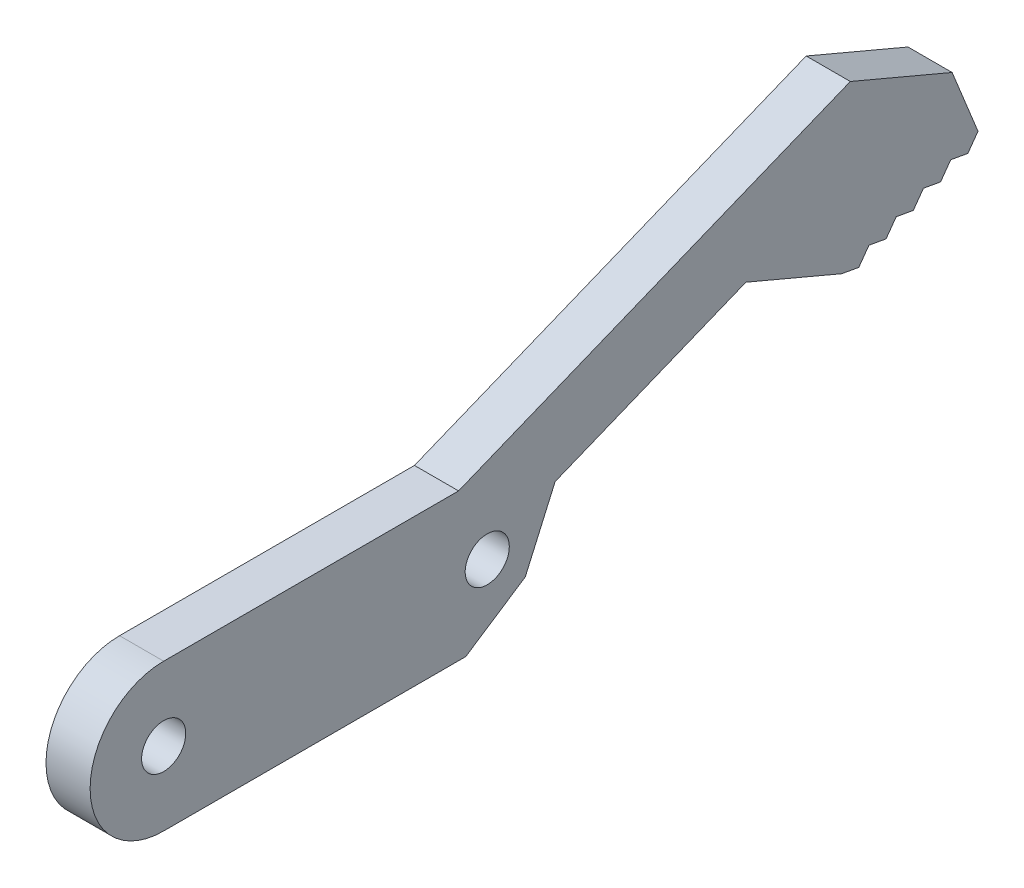
ISO-10303-21;
HEADER;
FILE_DESCRIPTION(('STEP AP214'),'2;1');
FILE_NAME('part.step','',(''),(''),'','','');
FILE_SCHEMA(('AUTOMOTIVE_DESIGN { 1 0 10303 214 1 1 1 1 }'));
ENDSEC;
DATA;
#1=APPLICATION_CONTEXT('core data for automotive mechanical design processes');
#2=APPLICATION_PROTOCOL_DEFINITION('international standard','automotive_design',2000,#1);
#3=PRODUCT_CONTEXT('',#1,'mechanical');
#4=PRODUCT('Part','Part','',(#3));
#5=PRODUCT_RELATED_PRODUCT_CATEGORY('part','',(#4));
#6=PRODUCT_DEFINITION_FORMATION('','',#4);
#7=PRODUCT_DEFINITION_CONTEXT('part definition',#1,'design');
#8=PRODUCT_DEFINITION('design','',#6,#7);
#9=PRODUCT_DEFINITION_SHAPE('','',#8);
#10=(LENGTH_UNIT() NAMED_UNIT(*) SI_UNIT(.MILLI.,.METRE.));
#11=(NAMED_UNIT(*) PLANE_ANGLE_UNIT() SI_UNIT($,.RADIAN.));
#12=(NAMED_UNIT(*) SI_UNIT($,.STERADIAN.) SOLID_ANGLE_UNIT());
#13=UNCERTAINTY_MEASURE_WITH_UNIT(LENGTH_MEASURE(1.E-05),#10,'distance_accuracy_value','');
#14=(GEOMETRIC_REPRESENTATION_CONTEXT(3) GLOBAL_UNCERTAINTY_ASSIGNED_CONTEXT((#13)) GLOBAL_UNIT_ASSIGNED_CONTEXT((#10,
#11,#12)) REPRESENTATION_CONTEXT('',''));
#15=CARTESIAN_POINT('',(0.,0.,0.));
#16=DIRECTION('',(0.,0.,1.));
#17=DIRECTION('',(1.,0.,0.));
#18=AXIS2_PLACEMENT_3D('',#15,#16,#17);
#19=CARTESIAN_POINT('',(3.,5.,-42.2186144567226));
#20=DIRECTION('',(1.,0.,0.));
#21=DIRECTION('',(0.,0.,-1.));
#22=AXIS2_PLACEMENT_3D('',#19,#20,#21);
#23=PLANE('',#22);
#24=CARTESIAN_POINT('',(3.,5.,-5.));
#25=DIRECTION('',(1.,0.,0.));
#26=DIRECTION('',(0.,0.,-1.));
#27=AXIS2_PLACEMENT_3D('',#24,#25,#26);
#28=CIRCLE('',#27,1.5);
#29=CARTESIAN_POINT('',(3.,5.,-6.5));
#30=VERTEX_POINT('',#29);
#31=EDGE_CURVE('E152',#30,#30,#28,.T.);
#32=ORIENTED_EDGE('',*,*,#31,.F.);
#33=EDGE_LOOP('',(#32));
#34=FACE_BOUND('',#33,.T.);
#35=CARTESIAN_POINT('',(3.,5.,-27.));
#36=DIRECTION('',(1.,0.,0.));
#37=DIRECTION('',(0.,0.,-1.));
#38=AXIS2_PLACEMENT_3D('',#35,#36,#37);
#39=CIRCLE('',#38,1.5);
#40=CARTESIAN_POINT('',(3.,5.,-28.5));
#41=VERTEX_POINT('',#40);
#42=EDGE_CURVE('E123',#41,#41,#39,.T.);
#43=ORIENTED_EDGE('',*,*,#42,.F.);
#44=EDGE_LOOP('',(#43));
#45=FACE_BOUND('',#44,.T.);
#46=DIRECTION('',(0.,-0.17631045866029,-0.984334608843455));
#47=VECTOR('',#46,1.);
#48=CARTESIAN_POINT('',(3.,22.5251811729284,-4.03462906650347));
#49=LINE('',#48,#47);
#50=CARTESIAN_POINT('',(3.,12.7674293983212,-58.5117874224691));
#51=VERTEX_POINT('',#50);
#52=CARTESIAN_POINT('',(3.,12.5590471430907,-59.6751776560989));
#53=VERTEX_POINT('',#52);
#54=EDGE_CURVE('E327',#51,#53,#49,.T.);
#55=ORIENTED_EDGE('',*,*,#54,.T.);
#56=DIRECTION('',(0.,0.811746559900308,-0.58400986506224));
#57=VECTOR('',#56,1.);
#58=CARTESIAN_POINT('',(3.,-24.0066089622226,-33.3680703114137));
#59=LINE('',#58,#57);
#60=CARTESIAN_POINT('',(3.,13.5184546570459,-60.365421976732));
#61=VERTEX_POINT('',#60);
#62=EDGE_CURVE('E342',#53,#61,#59,.T.);
#63=ORIENTED_EDGE('',*,*,#62,.T.);
#64=DIRECTION('',(0.,0.926817277131444,0.37551262936239));
#65=VECTOR('',#64,1.);
#66=CARTESIAN_POINT('',(3.,22.9153076592473,-56.5581591368443));
#67=LINE('',#66,#65);
#68=CARTESIAN_POINT('',(3.,17.8605936004067,-58.6061453081692));
#69=VERTEX_POINT('',#68);
#70=EDGE_CURVE('E86',#61,#69,#67,.T.);
#71=ORIENTED_EDGE('',*,*,#70,.T.);
#72=DIRECTION('',(0.,-0.389831254937164,-0.920886308223831));
#73=VECTOR('',#72,1.);
#74=CARTESIAN_POINT('',(3.,36.1853832829632,-15.318061795041));
#75=LINE('',#74,#73);
#76=CARTESIAN_POINT('',(3.,20.7907778032993,-51.6842618551546));
#77=VERTEX_POINT('',#76);
#78=EDGE_CURVE('E240',#77,#69,#75,.T.);
#79=ORIENTED_EDGE('',*,*,#78,.F.);
#80=DIRECTION('',(0.,-0.375512629362391,0.926817277131444));
#81=VECTOR('',#80,1.);
#82=CARTESIAN_POINT('',(3.,-0.128680230886938,-0.0521365462638659));
#83=LINE('',#82,#81);
#84=CARTESIAN_POINT('',(3.,10.,-25.0511248584953));
#85=VERTEX_POINT('',#84);
#86=EDGE_CURVE('E208',#77,#85,#83,.T.);
#87=ORIENTED_EDGE('',*,*,#86,.T.);
#88=DIRECTION('',(0.,0.,-1.));
#89=VECTOR('',#88,1.);
#90=CARTESIAN_POINT('',(3.,10.,-42.2186144567226));
#91=LINE('',#90,#89);
#92=CARTESIAN_POINT('',(3.,10.,-5.));
#93=VERTEX_POINT('',#92);
#94=EDGE_CURVE('E138',#93,#85,#91,.T.);
#95=ORIENTED_EDGE('',*,*,#94,.F.);
#96=CARTESIAN_POINT('',(3.,5.,-5.));
#97=DIRECTION('',(1.,0.,0.));
#98=DIRECTION('',(0.,0.,-1.));
#99=AXIS2_PLACEMENT_3D('',#96,#97,#98);
#100=CIRCLE('',#99,5.);
#101=CARTESIAN_POINT('',(3.,0.,-5.));
#102=VERTEX_POINT('',#101);
#103=EDGE_CURVE('E94',#93,#102,#100,.T.);
#104=ORIENTED_EDGE('',*,*,#103,.T.);
#105=DIRECTION('',(0.,0.,-1.));
#106=VECTOR('',#105,1.);
#107=CARTESIAN_POINT('',(3.,0.,-42.2186144567226));
#108=LINE('',#107,#106);
#109=CARTESIAN_POINT('',(3.,0.,-25.5395379901429));
#110=VERTEX_POINT('',#109);
#111=EDGE_CURVE('E122',#102,#110,#108,.T.);
#112=ORIENTED_EDGE('',*,*,#111,.T.);
#113=DIRECTION('',(0.,-0.55021058417257,0.835025935563968));
#114=VECTOR('',#113,1.);
#115=CARTESIAN_POINT('',(3.,-11.7338880875041,-7.73162741930979));
#116=LINE('',#115,#114);
#117=CARTESIAN_POINT('',(3.,2.66487171427478,-29.5838749410881));
#118=VERTEX_POINT('',#117);
#119=EDGE_CURVE('E249',#118,#110,#116,.T.);
#120=ORIENTED_EDGE('',*,*,#119,.F.);
#121=DIRECTION('',(0.,-0.914855352080967,0.403781729117119));
#122=VECTOR('',#121,1.);
#123=CARTESIAN_POINT('',(3.,-10.4938590570204,-23.7761206860199));
#124=LINE('',#123,#122);
#125=CARTESIAN_POINT('',(3.,7.0958518163384,-31.5395379901429));
#126=VERTEX_POINT('',#125);
#127=EDGE_CURVE('E253',#126,#118,#124,.T.);
#128=ORIENTED_EDGE('',*,*,#127,.F.);
#129=DIRECTION('',(0.,-0.920886308223829,0.389831254937168));
#130=VECTOR('',#129,1.);
#131=CARTESIAN_POINT('',(3.,-10.2440418078816,-24.1991829086949));
#132=LINE('',#131,#130);
#133=CARTESIAN_POINT('',(3.,7.26267479119386,-31.6101577931083));
#134=VERTEX_POINT('',#133);
#135=EDGE_CURVE('E172',#134,#126,#132,.T.);
#136=ORIENTED_EDGE('',*,*,#135,.F.);
#137=DIRECTION('',(0.,0.375512629362391,-0.926817277131444));
#138=VECTOR('',#137,1.);
#139=CARTESIAN_POINT('',(3.,-4.76276661654416,-1.92969969307582));
#140=LINE('',#139,#138);
#141=CARTESIAN_POINT('',(3.,12.5198516022673,-44.5855996729485));
#142=VERTEX_POINT('',#141);
#143=EDGE_CURVE('E202',#134,#142,#140,.T.);
#144=ORIENTED_EDGE('',*,*,#143,.T.);
#145=DIRECTION('',(0.,-0.389831254937164,-0.920886308223831));
#146=VECTOR('',#145,1.);
#147=CARTESIAN_POINT('',(3.,26.6230259445322,-11.2701074187967));
#148=LINE('',#147,#146);
#149=CARTESIAN_POINT('',(3.,9.76332836342207,-51.0972492054176));
#150=VERTEX_POINT('',#149);
#151=EDGE_CURVE('E205',#142,#150,#148,.T.);
#152=ORIENTED_EDGE('',*,*,#151,.T.);
#153=DIRECTION('',(0.,-0.176310458660284,-0.984334608843456));
#154=VECTOR('',#153,1.);
#155=CARTESIAN_POINT('',(3.,18.3276818691169,-3.28278815708864));
#156=LINE('',#155,#154);
#157=CARTESIAN_POINT('',(3.,9.55494610819164,-52.2606394390473));
#158=VERTEX_POINT('',#157);
#159=EDGE_CURVE('E262',#150,#158,#156,.T.);
#160=ORIENTED_EDGE('',*,*,#159,.T.);
#161=DIRECTION('',(0.,0.811746559900305,-0.584009865062245));
#162=VECTOR('',#161,1.);
#163=CARTESIAN_POINT('',(3.,-21.5162149640903,-29.9065384406036));
#164=LINE('',#163,#162);
#165=CARTESIAN_POINT('',(3.,10.5143536221468,-52.9508837596805));
#166=VERTEX_POINT('',#165);
#167=EDGE_CURVE('E273',#158,#166,#164,.T.);
#168=ORIENTED_EDGE('',*,*,#167,.T.);
#169=DIRECTION('',(0.,-0.176310458660287,-0.984334608843456));
#170=VECTOR('',#169,1.);
#171=CARTESIAN_POINT('',(3.,19.3770566950698,-3.47074838444237));
#172=LINE('',#171,#170);
#173=CARTESIAN_POINT('',(3.,10.3059713669164,-54.1142739933102));
#174=VERTEX_POINT('',#173);
#175=EDGE_CURVE('E280',#166,#174,#172,.T.);
#176=ORIENTED_EDGE('',*,*,#175,.T.);
#177=DIRECTION('',(0.,0.811746559900305,-0.584009865062244));
#178=VECTOR('',#177,1.);
#179=CARTESIAN_POINT('',(3.,-22.1388134636234,-30.7719214083061));
#180=LINE('',#179,#178);
#181=CARTESIAN_POINT('',(3.,11.2653788808716,-54.8045183139433));
#182=VERTEX_POINT('',#181);
#183=EDGE_CURVE('E277',#174,#182,#180,.T.);
#184=ORIENTED_EDGE('',*,*,#183,.T.);
#185=DIRECTION('',(0.,-0.176310458660285,-0.984334608843456));
#186=VECTOR('',#185,1.);
#187=CARTESIAN_POINT('',(3.,20.4264315210225,-3.65870861179599));
#188=LINE('',#187,#186);
#189=CARTESIAN_POINT('',(3.,11.0569966256412,-55.9679085475731));
#190=VERTEX_POINT('',#189);
#191=EDGE_CURVE('E292',#182,#190,#188,.T.);
#192=ORIENTED_EDGE('',*,*,#191,.T.);
#193=DIRECTION('',(0.,0.811746559900305,-0.584009865062245));
#194=VECTOR('',#193,1.);
#195=CARTESIAN_POINT('',(3.,-22.7614119631564,-31.6373043760085));
#196=LINE('',#195,#194);
#197=CARTESIAN_POINT('',(3.,12.0164041395964,-56.6581528682062));
#198=VERTEX_POINT('',#197);
#199=EDGE_CURVE('E291',#190,#198,#196,.T.);
#200=ORIENTED_EDGE('',*,*,#199,.T.);
#201=DIRECTION('',(0.,-0.176310458660293,-0.984334608843455));
#202=VECTOR('',#201,1.);
#203=CARTESIAN_POINT('',(3.,21.4758063469757,-3.8466688391499));
#204=LINE('',#203,#202);
#205=CARTESIAN_POINT('',(3.,11.808021884366,-57.821543101836));
#206=VERTEX_POINT('',#205);
#207=EDGE_CURVE('E310',#198,#206,#204,.T.);
#208=ORIENTED_EDGE('',*,*,#207,.T.);
#209=DIRECTION('',(0.,0.811746559900307,-0.584009865062241));
#210=VECTOR('',#209,1.);
#211=CARTESIAN_POINT('',(3.,-23.3840104626895,-32.5026873437112));
#212=LINE('',#211,#210);
#213=EDGE_CURVE('E309',#206,#51,#212,.T.);
#214=ORIENTED_EDGE('',*,*,#213,.T.);
#215=EDGE_LOOP('',(#55,#63,#71,#79,#87,#95,#104,#112,#120,#128,#136,#144,#152,#160,#168,#176,
#184,#192,#200,#208,#214));
#216=FACE_BOUND('',#215,.T.);
#217=ADVANCED_FACE('F71',(#34,#45,#216),#23,.T.);
#218=CARTESIAN_POINT('',(0.,5.,-42.2186144567226));
#219=DIRECTION('',(1.,0.,0.));
#220=DIRECTION('',(0.,0.,-1.));
#221=AXIS2_PLACEMENT_3D('',#218,#219,#220);
#222=PLANE('',#221);
#223=CARTESIAN_POINT('',(0.,5.,-5.));
#224=DIRECTION('',(1.,0.,0.));
#225=DIRECTION('',(0.,0.,-1.));
#226=AXIS2_PLACEMENT_3D('',#223,#224,#225);
#227=CIRCLE('',#226,1.5);
#228=CARTESIAN_POINT('',(0.,5.,-6.5));
#229=VERTEX_POINT('',#228);
#230=EDGE_CURVE('E130',#229,#229,#227,.T.);
#231=ORIENTED_EDGE('',*,*,#230,.T.);
#232=EDGE_LOOP('',(#231));
#233=FACE_BOUND('',#232,.T.);
#234=CARTESIAN_POINT('',(0.,5.,-27.));
#235=DIRECTION('',(1.,0.,0.));
#236=DIRECTION('',(0.,0.,-1.));
#237=AXIS2_PLACEMENT_3D('',#234,#235,#236);
#238=CIRCLE('',#237,1.5);
#239=CARTESIAN_POINT('',(0.,5.,-28.5));
#240=VERTEX_POINT('',#239);
#241=EDGE_CURVE('E133',#240,#240,#238,.T.);
#242=ORIENTED_EDGE('',*,*,#241,.T.);
#243=EDGE_LOOP('',(#242));
#244=FACE_BOUND('',#243,.T.);
#245=DIRECTION('',(0.,-0.811746559900308,0.58400986506224));
#246=VECTOR('',#245,1.);
#247=CARTESIAN_POINT('',(0.,-24.0066089622226,-33.3680703114137));
#248=LINE('',#247,#246);
#249=CARTESIAN_POINT('',(0.,13.5184546570459,-60.365421976732));
#250=VERTEX_POINT('',#249);
#251=CARTESIAN_POINT('',(0.,12.5590471430907,-59.6751776560989));
#252=VERTEX_POINT('',#251);
#253=EDGE_CURVE('E340',#250,#252,#248,.T.);
#254=ORIENTED_EDGE('',*,*,#253,.T.);
#255=DIRECTION('',(0.,0.17631045866029,0.984334608843455));
#256=VECTOR('',#255,1.);
#257=CARTESIAN_POINT('',(0.,22.5251811729284,-4.03462906650347));
#258=LINE('',#257,#256);
#259=CARTESIAN_POINT('',(0.,12.7674293983212,-58.5117874224691));
#260=VERTEX_POINT('',#259);
#261=EDGE_CURVE('E323',#252,#260,#258,.T.);
#262=ORIENTED_EDGE('',*,*,#261,.T.);
#263=DIRECTION('',(0.,-0.811746559900307,0.584009865062241));
#264=VECTOR('',#263,1.);
#265=CARTESIAN_POINT('',(0.,-23.3840104626895,-32.5026873437112));
#266=LINE('',#265,#264);
#267=CARTESIAN_POINT('',(0.,11.808021884366,-57.821543101836));
#268=VERTEX_POINT('',#267);
#269=EDGE_CURVE('E333',#260,#268,#266,.T.);
#270=ORIENTED_EDGE('',*,*,#269,.T.);
#271=DIRECTION('',(0.,0.176310458660293,0.984334608843455));
#272=VECTOR('',#271,1.);
#273=CARTESIAN_POINT('',(0.,21.4758063469757,-3.8466688391499));
#274=LINE('',#273,#272);
#275=CARTESIAN_POINT('',(0.,12.0164041395964,-56.6581528682062));
#276=VERTEX_POINT('',#275);
#277=EDGE_CURVE('E305',#268,#276,#274,.T.);
#278=ORIENTED_EDGE('',*,*,#277,.T.);
#279=DIRECTION('',(0.,-0.811746559900304,0.584009865062245));
#280=VECTOR('',#279,1.);
#281=CARTESIAN_POINT('',(0.,-22.7614119631564,-31.6373043760085));
#282=LINE('',#281,#280);
#283=CARTESIAN_POINT('',(0.,11.0569966256412,-55.9679085475731));
#284=VERTEX_POINT('',#283);
#285=EDGE_CURVE('E316',#276,#284,#282,.T.);
#286=ORIENTED_EDGE('',*,*,#285,.T.);
#287=DIRECTION('',(0.,0.176310458660285,0.984334608843456));
#288=VECTOR('',#287,1.);
#289=CARTESIAN_POINT('',(0.,20.4264315210225,-3.65870861179599));
#290=LINE('',#289,#288);
#291=CARTESIAN_POINT('',(0.,11.2653788808716,-54.8045183139433));
#292=VERTEX_POINT('',#291);
#293=EDGE_CURVE('E287',#284,#292,#290,.T.);
#294=ORIENTED_EDGE('',*,*,#293,.T.);
#295=DIRECTION('',(0.,-0.811746559900305,0.584009865062244));
#296=VECTOR('',#295,1.);
#297=CARTESIAN_POINT('',(0.,-22.1388134636234,-30.7719214083061));
#298=LINE('',#297,#296);
#299=CARTESIAN_POINT('',(0.,10.3059713669164,-54.1142739933102));
#300=VERTEX_POINT('',#299);
#301=EDGE_CURVE('E298',#292,#300,#298,.T.);
#302=ORIENTED_EDGE('',*,*,#301,.T.);
#303=DIRECTION('',(0.,0.176310458660287,0.984334608843456));
#304=VECTOR('',#303,1.);
#305=CARTESIAN_POINT('',(0.,19.3770566950698,-3.47074838444237));
#306=LINE('',#305,#304);
#307=CARTESIAN_POINT('',(0.,10.5143536221468,-52.9508837596805));
#308=VERTEX_POINT('',#307);
#309=EDGE_CURVE('E269',#300,#308,#306,.T.);
#310=ORIENTED_EDGE('',*,*,#309,.T.);
#311=DIRECTION('',(0.,-0.811746559900305,0.584009865062245));
#312=VECTOR('',#311,1.);
#313=CARTESIAN_POINT('',(0.,-21.5162149640903,-29.9065384406036));
#314=LINE('',#313,#312);
#315=CARTESIAN_POINT('',(0.,9.55494610819165,-52.2606394390473));
#316=VERTEX_POINT('',#315);
#317=EDGE_CURVE('E274',#308,#316,#314,.T.);
#318=ORIENTED_EDGE('',*,*,#317,.T.);
#319=DIRECTION('',(0.,0.176310458660284,0.984334608843456));
#320=VECTOR('',#319,1.);
#321=CARTESIAN_POINT('',(0.,18.3276818691169,-3.28278815708864));
#322=LINE('',#321,#320);
#323=CARTESIAN_POINT('',(0.,9.76332836342207,-51.0972492054176));
#324=VERTEX_POINT('',#323);
#325=EDGE_CURVE('E265',#316,#324,#322,.T.);
#326=ORIENTED_EDGE('',*,*,#325,.T.);
#327=DIRECTION('',(0.,-0.389831254937164,-0.920886308223831));
#328=VECTOR('',#327,1.);
#329=CARTESIAN_POINT('',(0.,26.6230259445322,-11.2701074187967));
#330=LINE('',#329,#328);
#331=CARTESIAN_POINT('',(0.,12.5198516022673,-44.5855996729485));
#332=VERTEX_POINT('',#331);
#333=EDGE_CURVE('E213',#332,#324,#330,.T.);
#334=ORIENTED_EDGE('',*,*,#333,.F.);
#335=DIRECTION('',(0.,0.375512629362391,-0.926817277131444));
#336=VECTOR('',#335,1.);
#337=CARTESIAN_POINT('',(0.,-4.76276661654416,-1.92969969307582));
#338=LINE('',#337,#336);
#339=CARTESIAN_POINT('',(0.,7.26267479119386,-31.6101577931083));
#340=VERTEX_POINT('',#339);
#341=EDGE_CURVE('E211',#340,#332,#338,.T.);
#342=ORIENTED_EDGE('',*,*,#341,.F.);
#343=DIRECTION('',(0.,-0.920886308223829,0.389831254937168));
#344=VECTOR('',#343,1.);
#345=CARTESIAN_POINT('',(0.,-10.2440418078816,-24.1991829086949));
#346=LINE('',#345,#344);
#347=CARTESIAN_POINT('',(0.,7.0958518163384,-31.5395379901429));
#348=VERTEX_POINT('',#347);
#349=EDGE_CURVE('E185',#340,#348,#346,.T.);
#350=ORIENTED_EDGE('',*,*,#349,.T.);
#351=DIRECTION('',(0.,0.914855352080967,-0.40378172911712));
#352=VECTOR('',#351,1.);
#353=CARTESIAN_POINT('',(0.,-10.4938590570204,-23.7761206860199));
#354=LINE('',#353,#352);
#355=CARTESIAN_POINT('',(0.,2.66487171427478,-29.5838749410881));
#356=VERTEX_POINT('',#355);
#357=EDGE_CURVE('E256',#356,#348,#354,.T.);
#358=ORIENTED_EDGE('',*,*,#357,.F.);
#359=DIRECTION('',(0.,0.55021058417257,-0.835025935563968));
#360=VECTOR('',#359,1.);
#361=CARTESIAN_POINT('',(0.,-11.7338880875041,-7.73162741930979));
#362=LINE('',#361,#360);
#363=CARTESIAN_POINT('',(0.,0.,-25.5395379901429));
#364=VERTEX_POINT('',#363);
#365=EDGE_CURVE('E129',#364,#356,#362,.T.);
#366=ORIENTED_EDGE('',*,*,#365,.F.);
#367=DIRECTION('',(0.,0.,-1.));
#368=VECTOR('',#367,1.);
#369=CARTESIAN_POINT('',(0.,0.,-42.2186144567226));
#370=LINE('',#369,#368);
#371=CARTESIAN_POINT('',(0.,0.,-5.));
#372=VERTEX_POINT('',#371);
#373=EDGE_CURVE('E114',#372,#364,#370,.T.);
#374=ORIENTED_EDGE('',*,*,#373,.F.);
#375=CARTESIAN_POINT('',(0.,5.,-5.));
#376=DIRECTION('',(1.,0.,0.));
#377=DIRECTION('',(0.,0.,-1.));
#378=AXIS2_PLACEMENT_3D('',#375,#376,#377);
#379=CIRCLE('',#378,5.);
#380=CARTESIAN_POINT('',(0.,10.,-5.));
#381=VERTEX_POINT('',#380);
#382=EDGE_CURVE('E106',#381,#372,#379,.T.);
#383=ORIENTED_EDGE('',*,*,#382,.F.);
#384=DIRECTION('',(0.,0.,-1.));
#385=VECTOR('',#384,1.);
#386=CARTESIAN_POINT('',(0.,10.,-42.2186144567226));
#387=LINE('',#386,#385);
#388=CARTESIAN_POINT('',(0.,10.,-25.0511248584953));
#389=VERTEX_POINT('',#388);
#390=EDGE_CURVE('E115',#381,#389,#387,.T.);
#391=ORIENTED_EDGE('',*,*,#390,.T.);
#392=DIRECTION('',(0.,-0.375512629362391,0.926817277131444));
#393=VECTOR('',#392,1.);
#394=CARTESIAN_POINT('',(0.,-0.128680230886938,-0.0521365462638659));
#395=LINE('',#394,#393);
#396=CARTESIAN_POINT('',(0.,20.7907778032993,-51.6842618551546));
#397=VERTEX_POINT('',#396);
#398=EDGE_CURVE('E192',#397,#389,#395,.T.);
#399=ORIENTED_EDGE('',*,*,#398,.F.);
#400=DIRECTION('',(0.,-0.389831254937164,-0.920886308223831));
#401=VECTOR('',#400,1.);
#402=CARTESIAN_POINT('',(0.,36.1853832829632,-15.318061795041));
#403=LINE('',#402,#401);
#404=CARTESIAN_POINT('',(0.,17.8605936004068,-58.6061453081692));
#405=VERTEX_POINT('',#404);
#406=EDGE_CURVE('E238',#397,#405,#403,.T.);
#407=ORIENTED_EDGE('',*,*,#406,.T.);
#408=DIRECTION('',(0.,0.926817277131444,0.37551262936239));
#409=VECTOR('',#408,1.);
#410=CARTESIAN_POINT('',(0.,22.9153076592473,-56.5581591368443));
#411=LINE('',#410,#409);
#412=EDGE_CURVE('E198',#250,#405,#411,.T.);
#413=ORIENTED_EDGE('',*,*,#412,.F.);
#414=EDGE_LOOP('',(#254,#262,#270,#278,#286,#294,#302,#310,#318,#326,#334,#342,#350,#358,#366,
#374,#383,#391,#399,#407,#413));
#415=FACE_BOUND('',#414,.T.);
#416=ADVANCED_FACE('F126',(#233,#244,#415),#222,.F.);
#417=CARTESIAN_POINT('',(0.,22.9153076592473,-56.5581591368443));
#418=DIRECTION('',(0.,0.37551262936239,-0.926817277131444));
#419=DIRECTION('',(0.,0.926817277131444,0.37551262936239));
#420=AXIS2_PLACEMENT_3D('',#417,#418,#419);
#421=PLANE('',#420);
#422=ORIENTED_EDGE('',*,*,#70,.F.);
#423=DIRECTION('',(1.,0.,0.));
#424=VECTOR('',#423,1.);
#425=CARTESIAN_POINT('',(-0.00100000000000013,13.5184546570459,-60.365421976732));
#426=LINE('',#425,#424);
#427=EDGE_CURVE('E230',#250,#61,#426,.T.);
#428=ORIENTED_EDGE('',*,*,#427,.F.);
#429=ORIENTED_EDGE('',*,*,#412,.T.);
#430=DIRECTION('',(1.,0.,0.));
#431=VECTOR('',#430,1.);
#432=CARTESIAN_POINT('',(0.,17.8605936004068,-58.6061453081692));
#433=LINE('',#432,#431);
#434=EDGE_CURVE('E206',#405,#69,#433,.T.);
#435=ORIENTED_EDGE('',*,*,#434,.T.);
#436=EDGE_LOOP('',(#422,#428,#429,#435));
#437=FACE_BOUND('',#436,.T.);
#438=ADVANCED_FACE('F227',(#437),#421,.T.);
#439=CARTESIAN_POINT('',(3.,10.,-42.2186144567226));
#440=DIRECTION('',(0.,1.,0.));
#441=DIRECTION('',(0.,0.,1.));
#442=AXIS2_PLACEMENT_3D('',#439,#440,#441);
#443=PLANE('',#442);
#444=DIRECTION('',(1.,0.,0.));
#445=VECTOR('',#444,1.);
#446=CARTESIAN_POINT('',(0.,10.,-25.0511248584953));
#447=LINE('',#446,#445);
#448=EDGE_CURVE('E169',#389,#85,#447,.T.);
#449=ORIENTED_EDGE('',*,*,#448,.F.);
#450=ORIENTED_EDGE('',*,*,#390,.F.);
#451=DIRECTION('',(-1.,0.,0.));
#452=VECTOR('',#451,1.);
#453=CARTESIAN_POINT('',(3.,10.,-5.));
#454=LINE('',#453,#452);
#455=EDGE_CURVE('E12',#93,#381,#454,.T.);
#456=ORIENTED_EDGE('',*,*,#455,.F.);
#457=ORIENTED_EDGE('',*,*,#94,.T.);
#458=EDGE_LOOP('',(#449,#450,#456,#457));
#459=FACE_BOUND('',#458,.T.);
#460=ADVANCED_FACE('F73',(#459),#443,.T.);
#461=CARTESIAN_POINT('',(3.,5.,-5.));
#462=DIRECTION('',(-1.,0.,0.));
#463=DIRECTION('',(0.,0.,1.));
#464=AXIS2_PLACEMENT_3D('',#461,#462,#463);
#465=CYLINDRICAL_SURFACE('',#464,5.);
#466=ORIENTED_EDGE('',*,*,#382,.T.);
#467=DIRECTION('',(-1.,0.,0.));
#468=VECTOR('',#467,1.);
#469=CARTESIAN_POINT('',(3.,0.,-5.));
#470=LINE('',#469,#468);
#471=EDGE_CURVE('E79',#102,#372,#470,.T.);
#472=ORIENTED_EDGE('',*,*,#471,.F.);
#473=ORIENTED_EDGE('',*,*,#103,.F.);
#474=ORIENTED_EDGE('',*,*,#455,.T.);
#475=EDGE_LOOP('',(#466,#472,#473,#474));
#476=FACE_BOUND('',#475,.T.);
#477=ADVANCED_FACE('F108',(#476),#465,.T.);
#478=CARTESIAN_POINT('',(3.,0.,-42.2186144567226));
#479=DIRECTION('',(0.,1.,0.));
#480=DIRECTION('',(0.,0.,1.));
#481=AXIS2_PLACEMENT_3D('',#478,#479,#480);
#482=PLANE('',#481);
#483=ORIENTED_EDGE('',*,*,#373,.T.);
#484=DIRECTION('',(1.,0.,0.));
#485=VECTOR('',#484,1.);
#486=CARTESIAN_POINT('',(-0.00100000000000013,0.,-25.5395379901429));
#487=LINE('',#486,#485);
#488=EDGE_CURVE('E245',#364,#110,#487,.T.);
#489=ORIENTED_EDGE('',*,*,#488,.T.);
#490=ORIENTED_EDGE('',*,*,#111,.F.);
#491=ORIENTED_EDGE('',*,*,#471,.T.);
#492=EDGE_LOOP('',(#483,#489,#490,#491));
#493=FACE_BOUND('',#492,.T.);
#494=ADVANCED_FACE('F119',(#493),#482,.F.);
#495=CARTESIAN_POINT('',(3.,5.,-5.));
#496=DIRECTION('',(-1.,0.,0.));
#497=DIRECTION('',(0.,0.,1.));
#498=AXIS2_PLACEMENT_3D('',#495,#496,#497);
#499=CYLINDRICAL_SURFACE('',#498,1.5);
#500=ORIENTED_EDGE('',*,*,#31,.T.);
#501=EDGE_LOOP('',(#500));
#502=FACE_BOUND('',#501,.T.);
#503=ORIENTED_EDGE('',*,*,#230,.F.);
#504=EDGE_LOOP('',(#503));
#505=FACE_BOUND('',#504,.T.);
#506=ADVANCED_FACE('F482',(#502,#505),#499,.F.);
#507=CARTESIAN_POINT('',(3.,5.,-27.));
#508=DIRECTION('',(-1.,0.,0.));
#509=DIRECTION('',(0.,0.,1.));
#510=AXIS2_PLACEMENT_3D('',#507,#508,#509);
#511=CYLINDRICAL_SURFACE('',#510,1.5);
#512=ORIENTED_EDGE('',*,*,#42,.T.);
#513=EDGE_LOOP('',(#512));
#514=FACE_BOUND('',#513,.T.);
#515=ORIENTED_EDGE('',*,*,#241,.F.);
#516=EDGE_LOOP('',(#515));
#517=FACE_BOUND('',#516,.T.);
#518=ADVANCED_FACE('F479',(#514,#517),#511,.F.);
#519=CARTESIAN_POINT('',(0.,-4.76276661654416,-1.92969969307582));
#520=DIRECTION('',(0.,-0.926817277131444,-0.375512629362391));
#521=DIRECTION('',(0.,0.375512629362391,-0.926817277131444));
#522=AXIS2_PLACEMENT_3D('',#519,#520,#521);
#523=PLANE('',#522);
#524=ORIENTED_EDGE('',*,*,#143,.F.);
#525=DIRECTION('',(1.,0.,0.));
#526=VECTOR('',#525,1.);
#527=CARTESIAN_POINT('',(0.,7.26267479119386,-31.6101577931083));
#528=LINE('',#527,#526);
#529=EDGE_CURVE('E156',#340,#134,#528,.T.);
#530=ORIENTED_EDGE('',*,*,#529,.F.);
#531=ORIENTED_EDGE('',*,*,#341,.T.);
#532=DIRECTION('',(1.,0.,0.));
#533=VECTOR('',#532,1.);
#534=CARTESIAN_POINT('',(0.,12.5198516022673,-44.5855996729485));
#535=LINE('',#534,#533);
#536=EDGE_CURVE('E148',#332,#142,#535,.T.);
#537=ORIENTED_EDGE('',*,*,#536,.T.);
#538=EDGE_LOOP('',(#524,#530,#531,#537));
#539=FACE_BOUND('',#538,.T.);
#540=ADVANCED_FACE('F476',(#539),#523,.T.);
#541=CARTESIAN_POINT('',(0.,-10.2440418078816,-24.1991829086949));
#542=DIRECTION('',(0.,0.389831254937168,0.920886308223829));
#543=DIRECTION('',(0.,-0.920886308223829,0.389831254937168));
#544=AXIS2_PLACEMENT_3D('',#541,#542,#543);
#545=PLANE('',#544);
#546=ORIENTED_EDGE('',*,*,#135,.T.);
#547=DIRECTION('',(1.,0.,0.));
#548=VECTOR('',#547,1.);
#549=CARTESIAN_POINT('',(0.,7.0958518163384,-31.5395379901429));
#550=LINE('',#549,#548);
#551=EDGE_CURVE('E160',#348,#126,#550,.T.);
#552=ORIENTED_EDGE('',*,*,#551,.F.);
#553=ORIENTED_EDGE('',*,*,#349,.F.);
#554=ORIENTED_EDGE('',*,*,#529,.T.);
#555=EDGE_LOOP('',(#546,#552,#553,#554));
#556=FACE_BOUND('',#555,.T.);
#557=ADVANCED_FACE('F499',(#556),#545,.F.);
#558=CARTESIAN_POINT('',(0.,-0.128680230886938,-0.0521365462638659));
#559=DIRECTION('',(0.,0.926817277131444,0.375512629362391));
#560=DIRECTION('',(0.,-0.375512629362391,0.926817277131444));
#561=AXIS2_PLACEMENT_3D('',#558,#559,#560);
#562=PLANE('',#561);
#563=DIRECTION('',(1.,0.,0.));
#564=VECTOR('',#563,1.);
#565=CARTESIAN_POINT('',(0.,20.7907778032993,-51.6842618551546));
#566=LINE('',#565,#564);
#567=EDGE_CURVE('E218',#397,#77,#566,.T.);
#568=ORIENTED_EDGE('',*,*,#567,.F.);
#569=ORIENTED_EDGE('',*,*,#398,.T.);
#570=ORIENTED_EDGE('',*,*,#448,.T.);
#571=ORIENTED_EDGE('',*,*,#86,.F.);
#572=EDGE_LOOP('',(#568,#569,#570,#571));
#573=FACE_BOUND('',#572,.T.);
#574=ADVANCED_FACE('F497',(#573),#562,.T.);
#575=CARTESIAN_POINT('',(0.,26.6230259445322,-11.2701074187967));
#576=DIRECTION('',(0.,-0.920886308223831,0.389831254937164));
#577=DIRECTION('',(0.,-0.389831254937164,-0.920886308223831));
#578=AXIS2_PLACEMENT_3D('',#575,#576,#577);
#579=PLANE('',#578);
#580=ORIENTED_EDGE('',*,*,#151,.F.);
#581=ORIENTED_EDGE('',*,*,#536,.F.);
#582=ORIENTED_EDGE('',*,*,#333,.T.);
#583=DIRECTION('',(1.,0.,0.));
#584=VECTOR('',#583,1.);
#585=CARTESIAN_POINT('',(0.,9.76332836342207,-51.0972492054176));
#586=LINE('',#585,#584);
#587=EDGE_CURVE('E176',#324,#150,#586,.T.);
#588=ORIENTED_EDGE('',*,*,#587,.T.);
#589=EDGE_LOOP('',(#580,#581,#582,#588));
#590=FACE_BOUND('',#589,.T.);
#591=ADVANCED_FACE('F430',(#590),#579,.T.);
#592=CARTESIAN_POINT('',(0.,36.1853832829632,-15.318061795041));
#593=DIRECTION('',(0.,-0.920886308223831,0.389831254937164));
#594=DIRECTION('',(0.,-0.389831254937164,-0.920886308223831));
#595=AXIS2_PLACEMENT_3D('',#592,#593,#594);
#596=PLANE('',#595);
#597=ORIENTED_EDGE('',*,*,#78,.T.);
#598=ORIENTED_EDGE('',*,*,#434,.F.);
#599=ORIENTED_EDGE('',*,*,#406,.F.);
#600=ORIENTED_EDGE('',*,*,#567,.T.);
#601=EDGE_LOOP('',(#597,#598,#599,#600));
#602=FACE_BOUND('',#601,.T.);
#603=ADVANCED_FACE('F236',(#602),#596,.F.);
#604=CARTESIAN_POINT('',(-0.00100000000000013,-10.4938590570204,-23.7761206860199));
#605=DIRECTION('',(0.,0.403781729117119,0.914855352080966));
#606=DIRECTION('',(0.,-0.914855352080967,0.40378172911712));
#607=AXIS2_PLACEMENT_3D('',#604,#605,#606);
#608=PLANE('',#607);
#609=ORIENTED_EDGE('',*,*,#357,.T.);
#610=ORIENTED_EDGE('',*,*,#551,.T.);
#611=ORIENTED_EDGE('',*,*,#127,.T.);
#612=DIRECTION('',(1.,0.,0.));
#613=VECTOR('',#612,1.);
#614=CARTESIAN_POINT('',(-0.00100000000000013,2.66487171427478,-29.5838749410881));
#615=LINE('',#614,#613);
#616=EDGE_CURVE('E246',#356,#118,#615,.T.);
#617=ORIENTED_EDGE('',*,*,#616,.F.);
#618=EDGE_LOOP('',(#609,#610,#611,#617));
#619=FACE_BOUND('',#618,.T.);
#620=ADVANCED_FACE('F509',(#619),#608,.F.);
#621=CARTESIAN_POINT('',(-0.00100000000000013,-11.7338880875041,-7.73162741930979));
#622=DIRECTION('',(0.,0.835025935563968,0.55021058417257));
#623=DIRECTION('',(0.,-0.55021058417257,0.835025935563968));
#624=AXIS2_PLACEMENT_3D('',#621,#622,#623);
#625=PLANE('',#624);
#626=ORIENTED_EDGE('',*,*,#365,.T.);
#627=ORIENTED_EDGE('',*,*,#616,.T.);
#628=ORIENTED_EDGE('',*,*,#119,.T.);
#629=ORIENTED_EDGE('',*,*,#488,.F.);
#630=EDGE_LOOP('',(#626,#627,#628,#629));
#631=FACE_BOUND('',#630,.T.);
#632=ADVANCED_FACE('F512',(#631),#625,.F.);
#633=CARTESIAN_POINT('',(-0.00100000000000013,18.3276818691169,-3.28278815708864));
#634=DIRECTION('',(0.,-0.984334608843456,0.176310458660284));
#635=DIRECTION('',(0.,-0.176310458660284,-0.984334608843456));
#636=AXIS2_PLACEMENT_3D('',#633,#634,#635);
#637=PLANE('',#636);
#638=DIRECTION('',(1.,0.,0.));
#639=VECTOR('',#638,1.);
#640=CARTESIAN_POINT('',(-0.00100000000000013,9.55494610819164,-52.2606394390473));
#641=LINE('',#640,#639);
#642=EDGE_CURVE('E259',#316,#158,#641,.T.);
#643=ORIENTED_EDGE('',*,*,#642,.T.);
#644=ORIENTED_EDGE('',*,*,#159,.F.);
#645=ORIENTED_EDGE('',*,*,#587,.F.);
#646=ORIENTED_EDGE('',*,*,#325,.F.);
#647=EDGE_LOOP('',(#643,#644,#645,#646));
#648=FACE_BOUND('',#647,.T.);
#649=ADVANCED_FACE('F428',(#648),#637,.T.);
#650=CARTESIAN_POINT('',(-0.00100000000000013,-21.5162149640903,-29.9065384406036));
#651=DIRECTION('',(0.,-0.584009865062245,-0.811746559900305));
#652=DIRECTION('',(0.,0.811746559900305,-0.584009865062245));
#653=AXIS2_PLACEMENT_3D('',#650,#651,#652);
#654=PLANE('',#653);
#655=DIRECTION('',(1.,0.,0.));
#656=VECTOR('',#655,1.);
#657=CARTESIAN_POINT('',(-0.00100000000000013,10.5143536221468,-52.9508837596805));
#658=LINE('',#657,#656);
#659=EDGE_CURVE('E272',#308,#166,#658,.T.);
#660=ORIENTED_EDGE('',*,*,#659,.T.);
#661=ORIENTED_EDGE('',*,*,#167,.F.);
#662=ORIENTED_EDGE('',*,*,#642,.F.);
#663=ORIENTED_EDGE('',*,*,#317,.F.);
#664=EDGE_LOOP('',(#660,#661,#662,#663));
#665=FACE_BOUND('',#664,.T.);
#666=ADVANCED_FACE('F435',(#665),#654,.T.);
#667=CARTESIAN_POINT('',(-0.00100000000000013,19.3770566950698,-3.47074838444237));
#668=DIRECTION('',(0.,-0.984334608843456,0.176310458660287));
#669=DIRECTION('',(0.,-0.176310458660287,-0.984334608843456));
#670=AXIS2_PLACEMENT_3D('',#667,#668,#669);
#671=PLANE('',#670);
#672=DIRECTION('',(1.,0.,0.));
#673=VECTOR('',#672,1.);
#674=CARTESIAN_POINT('',(-0.00100000000000013,10.3059713669164,-54.1142739933102));
#675=LINE('',#674,#673);
#676=EDGE_CURVE('E268',#300,#174,#675,.T.);
#677=ORIENTED_EDGE('',*,*,#676,.T.);
#678=ORIENTED_EDGE('',*,*,#175,.F.);
#679=ORIENTED_EDGE('',*,*,#659,.F.);
#680=ORIENTED_EDGE('',*,*,#309,.F.);
#681=EDGE_LOOP('',(#677,#678,#679,#680));
#682=FACE_BOUND('',#681,.T.);
#683=ADVANCED_FACE('F438',(#682),#671,.T.);
#684=CARTESIAN_POINT('',(-0.00100000000000013,20.4264315210225,-3.65870861179599));
#685=DIRECTION('',(0.,-0.984334608843456,0.176310458660285));
#686=DIRECTION('',(0.,-0.176310458660285,-0.984334608843456));
#687=AXIS2_PLACEMENT_3D('',#684,#685,#686);
#688=PLANE('',#687);
#689=DIRECTION('',(1.,0.,0.));
#690=VECTOR('',#689,1.);
#691=CARTESIAN_POINT('',(-0.00100000000000013,11.0569966256412,-55.9679085475731));
#692=LINE('',#691,#690);
#693=EDGE_CURVE('E295',#284,#190,#692,.T.);
#694=ORIENTED_EDGE('',*,*,#693,.T.);
#695=ORIENTED_EDGE('',*,*,#191,.F.);
#696=DIRECTION('',(1.,0.,0.));
#697=VECTOR('',#696,1.);
#698=CARTESIAN_POINT('',(-0.00100000000000013,11.2653788808716,-54.8045183139433));
#699=LINE('',#698,#697);
#700=EDGE_CURVE('E290',#292,#182,#699,.T.);
#701=ORIENTED_EDGE('',*,*,#700,.F.);
#702=ORIENTED_EDGE('',*,*,#293,.F.);
#703=EDGE_LOOP('',(#694,#695,#701,#702));
#704=FACE_BOUND('',#703,.T.);
#705=ADVANCED_FACE('F445',(#704),#688,.T.);
#706=CARTESIAN_POINT('',(-0.00100000000000013,-22.1388134636234,-30.7719214083061));
#707=DIRECTION('',(0.,-0.584009865062244,-0.811746559900305));
#708=DIRECTION('',(0.,0.811746559900305,-0.584009865062244));
#709=AXIS2_PLACEMENT_3D('',#706,#707,#708);
#710=PLANE('',#709);
#711=ORIENTED_EDGE('',*,*,#700,.T.);
#712=ORIENTED_EDGE('',*,*,#183,.F.);
#713=ORIENTED_EDGE('',*,*,#676,.F.);
#714=ORIENTED_EDGE('',*,*,#301,.F.);
#715=EDGE_LOOP('',(#711,#712,#713,#714));
#716=FACE_BOUND('',#715,.T.);
#717=ADVANCED_FACE('F441',(#716),#710,.T.);
#718=CARTESIAN_POINT('',(-0.00100000000000013,21.4758063469757,-3.8466688391499));
#719=DIRECTION('',(0.,-0.984334608843455,0.176310458660293));
#720=DIRECTION('',(0.,-0.176310458660293,-0.984334608843455));
#721=AXIS2_PLACEMENT_3D('',#718,#719,#720);
#722=PLANE('',#721);
#723=DIRECTION('',(1.,0.,0.));
#724=VECTOR('',#723,1.);
#725=CARTESIAN_POINT('',(-0.00100000000000013,11.808021884366,-57.821543101836));
#726=LINE('',#725,#724);
#727=EDGE_CURVE('E313',#268,#206,#726,.T.);
#728=ORIENTED_EDGE('',*,*,#727,.T.);
#729=ORIENTED_EDGE('',*,*,#207,.F.);
#730=DIRECTION('',(1.,0.,0.));
#731=VECTOR('',#730,1.);
#732=CARTESIAN_POINT('',(-0.00100000000000013,12.0164041395964,-56.6581528682062));
#733=LINE('',#732,#731);
#734=EDGE_CURVE('E308',#276,#198,#733,.T.);
#735=ORIENTED_EDGE('',*,*,#734,.F.);
#736=ORIENTED_EDGE('',*,*,#277,.F.);
#737=EDGE_LOOP('',(#728,#729,#735,#736));
#738=FACE_BOUND('',#737,.T.);
#739=ADVANCED_FACE('F451',(#738),#722,.T.);
#740=CARTESIAN_POINT('',(-0.00100000000000013,-22.7614119631564,-31.6373043760085));
#741=DIRECTION('',(0.,-0.584009865062245,-0.811746559900304));
#742=DIRECTION('',(0.,0.811746559900304,-0.584009865062245));
#743=AXIS2_PLACEMENT_3D('',#740,#741,#742);
#744=PLANE('',#743);
#745=ORIENTED_EDGE('',*,*,#734,.T.);
#746=ORIENTED_EDGE('',*,*,#199,.F.);
#747=ORIENTED_EDGE('',*,*,#693,.F.);
#748=ORIENTED_EDGE('',*,*,#285,.F.);
#749=EDGE_LOOP('',(#745,#746,#747,#748));
#750=FACE_BOUND('',#749,.T.);
#751=ADVANCED_FACE('F447',(#750),#744,.T.);
#752=CARTESIAN_POINT('',(-0.00100000000000013,22.5251811729284,-4.03462906650347));
#753=DIRECTION('',(0.,-0.984334608843455,0.17631045866029));
#754=DIRECTION('',(0.,-0.17631045866029,-0.984334608843455));
#755=AXIS2_PLACEMENT_3D('',#752,#753,#754);
#756=PLANE('',#755);
#757=DIRECTION('',(1.,0.,0.));
#758=VECTOR('',#757,1.);
#759=CARTESIAN_POINT('',(-0.00100000000000013,12.5590471430907,-59.6751776560989));
#760=LINE('',#759,#758);
#761=EDGE_CURVE('E330',#252,#53,#760,.T.);
#762=ORIENTED_EDGE('',*,*,#761,.T.);
#763=ORIENTED_EDGE('',*,*,#54,.F.);
#764=DIRECTION('',(1.,0.,0.));
#765=VECTOR('',#764,1.);
#766=CARTESIAN_POINT('',(-0.00100000000000013,12.7674293983212,-58.5117874224691));
#767=LINE('',#766,#765);
#768=EDGE_CURVE('E326',#260,#51,#767,.T.);
#769=ORIENTED_EDGE('',*,*,#768,.F.);
#770=ORIENTED_EDGE('',*,*,#261,.F.);
#771=EDGE_LOOP('',(#762,#763,#769,#770));
#772=FACE_BOUND('',#771,.T.);
#773=ADVANCED_FACE('F360',(#772),#756,.T.);
#774=CARTESIAN_POINT('',(-0.00100000000000013,-23.3840104626895,-32.5026873437112));
#775=DIRECTION('',(0.,-0.584009865062241,-0.811746559900307));
#776=DIRECTION('',(0.,0.811746559900307,-0.584009865062241));
#777=AXIS2_PLACEMENT_3D('',#774,#775,#776);
#778=PLANE('',#777);
#779=ORIENTED_EDGE('',*,*,#768,.T.);
#780=ORIENTED_EDGE('',*,*,#213,.F.);
#781=ORIENTED_EDGE('',*,*,#727,.F.);
#782=ORIENTED_EDGE('',*,*,#269,.F.);
#783=EDGE_LOOP('',(#779,#780,#781,#782));
#784=FACE_BOUND('',#783,.T.);
#785=ADVANCED_FACE('F455',(#784),#778,.T.);
#786=CARTESIAN_POINT('',(-0.00100000000000013,-24.0066089622226,-33.3680703114137));
#787=DIRECTION('',(0.,-0.58400986506224,-0.811746559900308));
#788=DIRECTION('',(0.,0.811746559900308,-0.58400986506224));
#789=AXIS2_PLACEMENT_3D('',#786,#787,#788);
#790=PLANE('',#789);
#791=ORIENTED_EDGE('',*,*,#427,.T.);
#792=ORIENTED_EDGE('',*,*,#62,.F.);
#793=ORIENTED_EDGE('',*,*,#761,.F.);
#794=ORIENTED_EDGE('',*,*,#253,.F.);
#795=EDGE_LOOP('',(#791,#792,#793,#794));
#796=FACE_BOUND('',#795,.T.);
#797=ADVANCED_FACE('F348',(#796),#790,.T.);
#798=CLOSED_SHELL('',(#217,#416,#438,#460,#477,#494,#506,#518,#540,#557,#574,#591,#603,#620,
#632,#649,#666,#683,#705,#717,#739,#751,#773,#785,#797));
#799=MANIFOLD_SOLID_BREP('B2',#798);
#800=ADVANCED_BREP_SHAPE_REPRESENTATION('',(#18,#799),#14);
#801=SHAPE_DEFINITION_REPRESENTATION(#9,#800);
ENDSEC;
END-ISO-10303-21;
